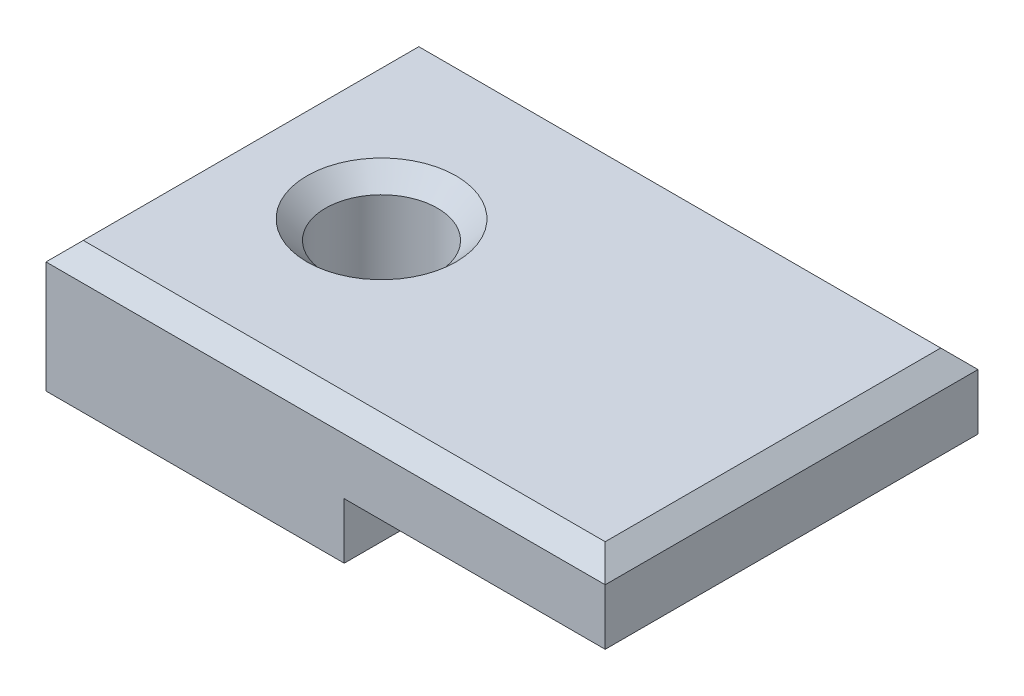
ISO-10303-21;
HEADER;
FILE_DESCRIPTION(('STEP AP214'),'2;1');
FILE_NAME('part.step','',(''),(''),'','','');
FILE_SCHEMA(('AUTOMOTIVE_DESIGN { 1 0 10303 214 1 1 1 1 }'));
ENDSEC;
DATA;
#1=APPLICATION_CONTEXT('core data for automotive mechanical design processes');
#2=APPLICATION_PROTOCOL_DEFINITION('international standard','automotive_design',2000,#1);
#3=PRODUCT_CONTEXT('',#1,'mechanical');
#4=PRODUCT('Part','Part','',(#3));
#5=PRODUCT_RELATED_PRODUCT_CATEGORY('part','',(#4));
#6=PRODUCT_DEFINITION_FORMATION('','',#4);
#7=PRODUCT_DEFINITION_CONTEXT('part definition',#1,'design');
#8=PRODUCT_DEFINITION('design','',#6,#7);
#9=PRODUCT_DEFINITION_SHAPE('','',#8);
#10=(LENGTH_UNIT() NAMED_UNIT(*) SI_UNIT(.MILLI.,.METRE.));
#11=(NAMED_UNIT(*) PLANE_ANGLE_UNIT() SI_UNIT($,.RADIAN.));
#12=(NAMED_UNIT(*) SI_UNIT($,.STERADIAN.) SOLID_ANGLE_UNIT());
#13=UNCERTAINTY_MEASURE_WITH_UNIT(LENGTH_MEASURE(1.E-05),#10,'distance_accuracy_value','');
#14=(GEOMETRIC_REPRESENTATION_CONTEXT(3) GLOBAL_UNCERTAINTY_ASSIGNED_CONTEXT((#13)) GLOBAL_UNIT_ASSIGNED_CONTEXT((#10,
#11,#12)) REPRESENTATION_CONTEXT('',''));
#15=CARTESIAN_POINT('',(0.,0.,0.));
#16=DIRECTION('',(0.,0.,1.));
#17=DIRECTION('',(1.,0.,0.));
#18=AXIS2_PLACEMENT_3D('',#15,#16,#17);
#19=CARTESIAN_POINT('',(0.,0.,0.));
#20=DIRECTION('',(0.,1.,0.));
#21=DIRECTION('',(0.,0.,1.));
#22=AXIS2_PLACEMENT_3D('',#19,#20,#21);
#23=PLANE('',#22);
#24=CARTESIAN_POINT('',(0.,0.,0.));
#25=DIRECTION('',(0.,1.,0.));
#26=DIRECTION('',(0.,0.,1.));
#27=AXIS2_PLACEMENT_3D('',#24,#25,#26);
#28=CIRCLE('',#27,3.);
#29=CARTESIAN_POINT('',(0.,0.,3.));
#30=VERTEX_POINT('',#29);
#31=EDGE_CURVE('E134',#30,#30,#28,.T.);
#32=ORIENTED_EDGE('',*,*,#31,.T.);
#33=EDGE_LOOP('',(#32));
#34=FACE_BOUND('',#33,.T.);
#35=DIRECTION('',(0.,0.,1.));
#36=VECTOR('',#35,1.);
#37=CARTESIAN_POINT('',(8.00000000000002,0.,10.));
#38=LINE('',#37,#36);
#39=CARTESIAN_POINT('',(8.00000000000002,0.,-9.99999999999998));
#40=VERTEX_POINT('',#39);
#41=CARTESIAN_POINT('',(8.00000000000002,0.,10.));
#42=VERTEX_POINT('',#41);
#43=EDGE_CURVE('E144',#40,#42,#38,.T.);
#44=ORIENTED_EDGE('',*,*,#43,.T.);
#45=DIRECTION('',(1.,0.,0.));
#46=VECTOR('',#45,1.);
#47=CARTESIAN_POINT('',(-8.,0.,10.));
#48=LINE('',#47,#46);
#49=CARTESIAN_POINT('',(-8.,0.,10.));
#50=VERTEX_POINT('',#49);
#51=EDGE_CURVE('E149',#50,#42,#48,.T.);
#52=ORIENTED_EDGE('',*,*,#51,.F.);
#53=DIRECTION('',(0.,0.,1.));
#54=VECTOR('',#53,1.);
#55=CARTESIAN_POINT('',(-8.00000000000002,0.,-10.));
#56=LINE('',#55,#54);
#57=CARTESIAN_POINT('',(-8.00000000000002,0.,-10.));
#58=VERTEX_POINT('',#57);
#59=EDGE_CURVE('E163',#58,#50,#56,.T.);
#60=ORIENTED_EDGE('',*,*,#59,.F.);
#61=DIRECTION('',(-1.,0.,0.));
#62=VECTOR('',#61,1.);
#63=CARTESIAN_POINT('',(-8.00000000000002,0.,-10.));
#64=LINE('',#63,#62);
#65=EDGE_CURVE('E169',#40,#58,#64,.T.);
#66=ORIENTED_EDGE('',*,*,#65,.F.);
#67=EDGE_LOOP('',(#44,#52,#60,#66));
#68=FACE_BOUND('',#67,.T.);
#69=ADVANCED_FACE('F46',(#34,#68),#23,.F.);
#70=CARTESIAN_POINT('',(22.,7.,-9.99999999999997));
#71=DIRECTION('',(-1.,0.,0.));
#72=DIRECTION('',(0.,0.,1.));
#73=AXIS2_PLACEMENT_3D('',#70,#71,#72);
#74=PLANE('',#73);
#75=DIRECTION('',(0.,-1.,0.));
#76=VECTOR('',#75,1.);
#77=CARTESIAN_POINT('',(22.,7.,-9.99999999999997));
#78=LINE('',#77,#76);
#79=CARTESIAN_POINT('',(22.,6.,-9.99999999999997));
#80=VERTEX_POINT('',#79);
#81=CARTESIAN_POINT('',(22.,3.,-9.99999999999997));
#82=VERTEX_POINT('',#81);
#83=EDGE_CURVE('E176',#80,#82,#78,.T.);
#84=ORIENTED_EDGE('',*,*,#83,.F.);
#85=DIRECTION('',(0.,0.,1.));
#86=VECTOR('',#85,1.);
#87=CARTESIAN_POINT('',(22.,6.,10.));
#88=LINE('',#87,#86);
#89=CARTESIAN_POINT('',(22.,6.,10.));
#90=VERTEX_POINT('',#89);
#91=EDGE_CURVE('E74',#80,#90,#88,.T.);
#92=ORIENTED_EDGE('',*,*,#91,.T.);
#93=DIRECTION('',(0.,-1.,0.));
#94=VECTOR('',#93,1.);
#95=CARTESIAN_POINT('',(22.,7.,10.));
#96=LINE('',#95,#94);
#97=CARTESIAN_POINT('',(22.,3.,10.));
#98=VERTEX_POINT('',#97);
#99=EDGE_CURVE('E179',#90,#98,#96,.T.);
#100=ORIENTED_EDGE('',*,*,#99,.T.);
#101=DIRECTION('',(0.,0.,1.));
#102=VECTOR('',#101,1.);
#103=CARTESIAN_POINT('',(22.,3.,-9.99999999999997));
#104=LINE('',#103,#102);
#105=EDGE_CURVE('E131',#82,#98,#104,.T.);
#106=ORIENTED_EDGE('',*,*,#105,.F.);
#107=EDGE_LOOP('',(#84,#92,#100,#106));
#108=FACE_BOUND('',#107,.T.);
#109=ADVANCED_FACE('F242',(#108),#74,.F.);
#110=CARTESIAN_POINT('',(-8.00000000000002,7.,-10.));
#111=DIRECTION('',(0.,0.,1.));
#112=DIRECTION('',(1.,0.,0.));
#113=AXIS2_PLACEMENT_3D('',#110,#111,#112);
#114=PLANE('',#113);
#115=DIRECTION('',(0.,-1.,0.));
#116=VECTOR('',#115,1.);
#117=CARTESIAN_POINT('',(-8.00000000000002,7.,-10.));
#118=LINE('',#117,#116);
#119=CARTESIAN_POINT('',(-8.00000000000002,6.,-10.));
#120=VERTEX_POINT('',#119);
#121=EDGE_CURVE('E173',#120,#58,#118,.T.);
#122=ORIENTED_EDGE('',*,*,#121,.F.);
#123=DIRECTION('',(1.,0.,0.));
#124=VECTOR('',#123,1.);
#125=CARTESIAN_POINT('',(22.,6.,-9.99999999999997));
#126=LINE('',#125,#124);
#127=EDGE_CURVE('E209',#120,#80,#126,.T.);
#128=ORIENTED_EDGE('',*,*,#127,.T.);
#129=ORIENTED_EDGE('',*,*,#83,.T.);
#130=DIRECTION('',(1.,0.,0.));
#131=VECTOR('',#130,1.);
#132=CARTESIAN_POINT('',(-8.00000000000002,3.,-10.));
#133=LINE('',#132,#131);
#134=CARTESIAN_POINT('',(8.00000000000002,3.,-10.));
#135=VERTEX_POINT('',#134);
#136=EDGE_CURVE('E185',#135,#82,#133,.T.);
#137=ORIENTED_EDGE('',*,*,#136,.F.);
#138=DIRECTION('',(0.,-1.,0.));
#139=VECTOR('',#138,1.);
#140=CARTESIAN_POINT('',(8.00000000000002,3.,-10.));
#141=LINE('',#140,#139);
#142=EDGE_CURVE('E141',#135,#40,#141,.T.);
#143=ORIENTED_EDGE('',*,*,#142,.T.);
#144=ORIENTED_EDGE('',*,*,#65,.T.);
#145=EDGE_LOOP('',(#122,#128,#129,#137,#143,#144));
#146=FACE_BOUND('',#145,.T.);
#147=ADVANCED_FACE('F241',(#146),#114,.F.);
#148=CARTESIAN_POINT('',(0.,7.,0.));
#149=DIRECTION('',(0.,1.,0.));
#150=DIRECTION('',(0.,0.,1.));
#151=AXIS2_PLACEMENT_3D('',#148,#149,#150);
#152=PLANE('',#151);
#153=CARTESIAN_POINT('',(0.,7.,0.));
#154=DIRECTION('',(0.,1.,0.));
#155=DIRECTION('',(0.,0.,1.));
#156=AXIS2_PLACEMENT_3D('',#153,#154,#155);
#157=CIRCLE('',#156,4.);
#158=CARTESIAN_POINT('',(0.,7.,4.));
#159=VERTEX_POINT('',#158);
#160=EDGE_CURVE('E205',#159,#159,#157,.F.);
#161=ORIENTED_EDGE('',*,*,#160,.T.);
#162=EDGE_LOOP('',(#161));
#163=FACE_BOUND('',#162,.T.);
#164=DIRECTION('',(0.,0.,-1.));
#165=VECTOR('',#164,1.);
#166=CARTESIAN_POINT('',(21.,7.,-9.99999999999997));
#167=LINE('',#166,#165);
#168=CARTESIAN_POINT('',(21.,7.,9.00000000000003));
#169=VERTEX_POINT('',#168);
#170=CARTESIAN_POINT('',(21.,7.,-8.99999999999998));
#171=VERTEX_POINT('',#170);
#172=EDGE_CURVE('E198',#169,#171,#167,.T.);
#173=ORIENTED_EDGE('',*,*,#172,.T.);
#174=DIRECTION('',(-1.,0.,0.));
#175=VECTOR('',#174,1.);
#176=CARTESIAN_POINT('',(-8.00000000000002,7.,-9.));
#177=LINE('',#176,#175);
#178=CARTESIAN_POINT('',(-7.00000000000002,7.,-9.));
#179=VERTEX_POINT('',#178);
#180=EDGE_CURVE('E201',#171,#179,#177,.T.);
#181=ORIENTED_EDGE('',*,*,#180,.T.);
#182=DIRECTION('',(0.,0.,1.));
#183=VECTOR('',#182,1.);
#184=CARTESIAN_POINT('',(-7.,7.,10.));
#185=LINE('',#184,#183);
#186=CARTESIAN_POINT('',(-7.,7.,9.00000000000002));
#187=VERTEX_POINT('',#186);
#188=EDGE_CURVE('E192',#179,#187,#185,.T.);
#189=ORIENTED_EDGE('',*,*,#188,.T.);
#190=DIRECTION('',(1.,0.,0.));
#191=VECTOR('',#190,1.);
#192=CARTESIAN_POINT('',(22.,7.,9.00000000000003));
#193=LINE('',#192,#191);
#194=EDGE_CURVE('E195',#187,#169,#193,.T.);
#195=ORIENTED_EDGE('',*,*,#194,.T.);
#196=EDGE_LOOP('',(#173,#181,#189,#195));
#197=FACE_BOUND('',#196,.T.);
#198=ADVANCED_FACE('F272',(#163,#197),#152,.T.);
#199=CARTESIAN_POINT('',(-8.00000000000002,7.,-10.));
#200=DIRECTION('',(1.,0.,0.));
#201=DIRECTION('',(0.,0.,-1.));
#202=AXIS2_PLACEMENT_3D('',#199,#200,#201);
#203=PLANE('',#202);
#204=DIRECTION('',(0.,-1.,0.));
#205=VECTOR('',#204,1.);
#206=CARTESIAN_POINT('',(-8.,7.,10.));
#207=LINE('',#206,#205);
#208=CARTESIAN_POINT('',(-8.,6.,10.));
#209=VERTEX_POINT('',#208);
#210=EDGE_CURVE('E182',#209,#50,#207,.T.);
#211=ORIENTED_EDGE('',*,*,#210,.F.);
#212=DIRECTION('',(0.,0.,-1.));
#213=VECTOR('',#212,1.);
#214=CARTESIAN_POINT('',(-8.00000000000002,6.,-10.));
#215=LINE('',#214,#213);
#216=EDGE_CURVE('E12',#209,#120,#215,.T.);
#217=ORIENTED_EDGE('',*,*,#216,.T.);
#218=ORIENTED_EDGE('',*,*,#121,.T.);
#219=ORIENTED_EDGE('',*,*,#59,.T.);
#220=EDGE_LOOP('',(#211,#217,#218,#219));
#221=FACE_BOUND('',#220,.T.);
#222=ADVANCED_FACE('F248',(#221),#203,.F.);
#223=CARTESIAN_POINT('',(-8.,7.,10.));
#224=DIRECTION('',(0.,0.,-1.));
#225=DIRECTION('',(-1.,0.,0.));
#226=AXIS2_PLACEMENT_3D('',#223,#224,#225);
#227=PLANE('',#226);
#228=ORIENTED_EDGE('',*,*,#99,.F.);
#229=DIRECTION('',(-1.,0.,0.));
#230=VECTOR('',#229,1.);
#231=CARTESIAN_POINT('',(-8.,6.,10.));
#232=LINE('',#231,#230);
#233=EDGE_CURVE('E57',#90,#209,#232,.T.);
#234=ORIENTED_EDGE('',*,*,#233,.T.);
#235=ORIENTED_EDGE('',*,*,#210,.T.);
#236=ORIENTED_EDGE('',*,*,#51,.T.);
#237=DIRECTION('',(0.,-1.,0.));
#238=VECTOR('',#237,1.);
#239=CARTESIAN_POINT('',(8.00000000000002,3.,10.));
#240=LINE('',#239,#238);
#241=CARTESIAN_POINT('',(8.00000000000002,3.,10.));
#242=VERTEX_POINT('',#241);
#243=EDGE_CURVE('E138',#242,#42,#240,.T.);
#244=ORIENTED_EDGE('',*,*,#243,.F.);
#245=DIRECTION('',(-1.,0.,0.));
#246=VECTOR('',#245,1.);
#247=CARTESIAN_POINT('',(-8.,3.,10.));
#248=LINE('',#247,#246);
#249=EDGE_CURVE('E124',#98,#242,#248,.T.);
#250=ORIENTED_EDGE('',*,*,#249,.F.);
#251=EDGE_LOOP('',(#228,#234,#235,#236,#244,#250));
#252=FACE_BOUND('',#251,.T.);
#253=ADVANCED_FACE('F147',(#252),#227,.F.);
#254=CARTESIAN_POINT('',(0.,7.,0.));
#255=DIRECTION('',(0.,-1.,0.));
#256=DIRECTION('',(0.,0.,-1.));
#257=AXIS2_PLACEMENT_3D('',#254,#255,#256);
#258=CYLINDRICAL_SURFACE('',#257,3.);
#259=CARTESIAN_POINT('',(0.,6.00000000000001,0.));
#260=DIRECTION('',(0.,1.,0.));
#261=DIRECTION('',(0.,0.,1.));
#262=AXIS2_PLACEMENT_3D('',#259,#260,#261);
#263=CIRCLE('',#262,3.);
#264=CARTESIAN_POINT('',(0.,6.00000000000001,3.));
#265=VERTEX_POINT('',#264);
#266=EDGE_CURVE('E188',#265,#265,#263,.T.);
#267=ORIENTED_EDGE('',*,*,#266,.T.);
#268=EDGE_LOOP('',(#267));
#269=FACE_BOUND('',#268,.T.);
#270=ORIENTED_EDGE('',*,*,#31,.F.);
#271=EDGE_LOOP('',(#270));
#272=FACE_BOUND('',#271,.T.);
#273=ADVANCED_FACE('F278',(#269,#272),#258,.F.);
#274=CARTESIAN_POINT('',(6.99999999999999,3.,0.));
#275=DIRECTION('',(0.,-1.,0.));
#276=DIRECTION('',(0.,0.,-1.));
#277=AXIS2_PLACEMENT_3D('',#274,#275,#276);
#278=PLANE('',#277);
#279=ORIENTED_EDGE('',*,*,#249,.T.);
#280=DIRECTION('',(0.,0.,1.));
#281=VECTOR('',#280,1.);
#282=CARTESIAN_POINT('',(8.00000000000002,3.,10.));
#283=LINE('',#282,#281);
#284=EDGE_CURVE('E128',#135,#242,#283,.T.);
#285=ORIENTED_EDGE('',*,*,#284,.F.);
#286=ORIENTED_EDGE('',*,*,#136,.T.);
#287=ORIENTED_EDGE('',*,*,#105,.T.);
#288=EDGE_LOOP('',(#279,#285,#286,#287));
#289=FACE_BOUND('',#288,.T.);
#290=ADVANCED_FACE('F126',(#289),#278,.T.);
#291=CARTESIAN_POINT('',(8.00000000000002,3.,10.));
#292=DIRECTION('',(1.,0.,0.));
#293=DIRECTION('',(0.,0.,-1.));
#294=AXIS2_PLACEMENT_3D('',#291,#292,#293);
#295=PLANE('',#294);
#296=ORIENTED_EDGE('',*,*,#43,.F.);
#297=ORIENTED_EDGE('',*,*,#142,.F.);
#298=ORIENTED_EDGE('',*,*,#284,.T.);
#299=ORIENTED_EDGE('',*,*,#243,.T.);
#300=EDGE_LOOP('',(#296,#297,#298,#299));
#301=FACE_BOUND('',#300,.T.);
#302=ADVANCED_FACE('F137',(#301),#295,.T.);
#303=CARTESIAN_POINT('',(0.,6.00000000000001,0.));
#304=DIRECTION('',(0.,1.,0.));
#305=DIRECTION('',(0.,0.,1.));
#306=AXIS2_PLACEMENT_3D('',#303,#304,#305);
#307=CONICAL_SURFACE('',#306,3.,0.78539816339745);
#308=ORIENTED_EDGE('',*,*,#160,.F.);
#309=EDGE_LOOP('',(#308));
#310=FACE_BOUND('',#309,.T.);
#311=ORIENTED_EDGE('',*,*,#266,.F.);
#312=EDGE_LOOP('',(#311));
#313=FACE_BOUND('',#312,.T.);
#314=ADVANCED_FACE('F261',(#310,#313),#307,.F.);
#315=CARTESIAN_POINT('',(0.,7.,9.00000000000003));
#316=DIRECTION('',(0.,0.707106781186545,0.70710678118655));
#317=DIRECTION('',(-1.,0.,0.));
#318=AXIS2_PLACEMENT_3D('',#315,#316,#317);
#319=PLANE('',#318);
#320=DIRECTION('',(0.577350269189624,0.577350269189629,-0.577350269189625));
#321=VECTOR('',#320,1.);
#322=CARTESIAN_POINT('',(-4.00000000000002,10.,6.00000000000003));
#323=LINE('',#322,#321);
#324=EDGE_CURVE('E221',#209,#187,#323,.T.);
#325=ORIENTED_EDGE('',*,*,#324,.F.);
#326=ORIENTED_EDGE('',*,*,#233,.F.);
#327=DIRECTION('',(-0.577350269189624,0.577350269189629,-0.577350269189625));
#328=VECTOR('',#327,1.);
#329=CARTESIAN_POINT('',(14.,14.,2.00000000000006));
#330=LINE('',#329,#328);
#331=EDGE_CURVE('E51',#169,#90,#330,.F.);
#332=ORIENTED_EDGE('',*,*,#331,.F.);
#333=ORIENTED_EDGE('',*,*,#194,.F.);
#334=EDGE_LOOP('',(#325,#326,#332,#333));
#335=FACE_BOUND('',#334,.T.);
#336=ADVANCED_FACE('F49',(#335),#319,.T.);
#337=CARTESIAN_POINT('',(21.,7.,0.));
#338=DIRECTION('',(0.70710678118655,0.707106781186545,0.));
#339=DIRECTION('',(0.,0.,1.));
#340=AXIS2_PLACEMENT_3D('',#337,#338,#339);
#341=PLANE('',#340);
#342=ORIENTED_EDGE('',*,*,#331,.T.);
#343=ORIENTED_EDGE('',*,*,#91,.F.);
#344=DIRECTION('',(-0.577350269189625,0.577350269189629,0.577350269189624));
#345=VECTOR('',#344,1.);
#346=CARTESIAN_POINT('',(18.,10.,-6.));
#347=LINE('',#346,#345);
#348=EDGE_CURVE('E219',#171,#80,#347,.F.);
#349=ORIENTED_EDGE('',*,*,#348,.F.);
#350=ORIENTED_EDGE('',*,*,#172,.F.);
#351=EDGE_LOOP('',(#342,#343,#349,#350));
#352=FACE_BOUND('',#351,.T.);
#353=ADVANCED_FACE('F254',(#352),#341,.T.);
#354=CARTESIAN_POINT('',(-7.00000000000001,7.,0.));
#355=DIRECTION('',(-0.70710678118655,0.707106781186545,0.));
#356=DIRECTION('',(0.,0.,-1.));
#357=AXIS2_PLACEMENT_3D('',#354,#355,#356);
#358=PLANE('',#357);
#359=ORIENTED_EDGE('',*,*,#324,.T.);
#360=ORIENTED_EDGE('',*,*,#188,.F.);
#361=DIRECTION('',(-0.577350269189625,-0.577350269189628,-0.577350269189624));
#362=VECTOR('',#361,1.);
#363=CARTESIAN_POINT('',(-4.00000000000003,10.,-6.00000000000001));
#364=LINE('',#363,#362);
#365=EDGE_CURVE('E217',#120,#179,#364,.F.);
#366=ORIENTED_EDGE('',*,*,#365,.F.);
#367=ORIENTED_EDGE('',*,*,#216,.F.);
#368=EDGE_LOOP('',(#359,#360,#366,#367));
#369=FACE_BOUND('',#368,.T.);
#370=ADVANCED_FACE('F246',(#369),#358,.T.);
#371=CARTESIAN_POINT('',(0.,7.,-8.99999999999999));
#372=DIRECTION('',(0.,0.707106781186545,-0.70710678118655));
#373=DIRECTION('',(1.,0.,0.));
#374=AXIS2_PLACEMENT_3D('',#371,#372,#373);
#375=PLANE('',#374);
#376=ORIENTED_EDGE('',*,*,#348,.T.);
#377=ORIENTED_EDGE('',*,*,#127,.F.);
#378=ORIENTED_EDGE('',*,*,#365,.T.);
#379=ORIENTED_EDGE('',*,*,#180,.F.);
#380=EDGE_LOOP('',(#376,#377,#378,#379));
#381=FACE_BOUND('',#380,.T.);
#382=ADVANCED_FACE('F251',(#381),#375,.T.);
#383=CLOSED_SHELL('',(#69,#109,#147,#198,#222,#253,#273,#290,#302,#314,#336,#353,#370,#382));
#384=MANIFOLD_SOLID_BREP('B2',#383);
#385=ADVANCED_BREP_SHAPE_REPRESENTATION('',(#18,#384),#14);
#386=SHAPE_DEFINITION_REPRESENTATION(#9,#385);
ENDSEC;
END-ISO-10303-21;
